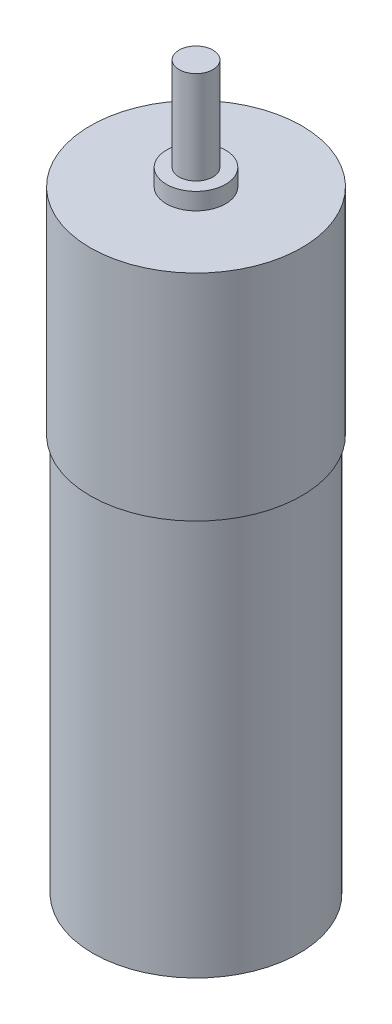
ISO-10303-21;
HEADER;
FILE_DESCRIPTION(('STEP AP214'),'2;1');
FILE_NAME('part.step','',(''),(''),'','','');
FILE_SCHEMA(('AUTOMOTIVE_DESIGN { 1 0 10303 214 1 1 1 1 }'));
ENDSEC;
DATA;
#1=APPLICATION_CONTEXT('core data for automotive mechanical design processes');
#2=APPLICATION_PROTOCOL_DEFINITION('international standard','automotive_design',2000,#1);
#3=PRODUCT_CONTEXT('',#1,'mechanical');
#4=PRODUCT('Part','Part','',(#3));
#5=PRODUCT_RELATED_PRODUCT_CATEGORY('part','',(#4));
#6=PRODUCT_DEFINITION_FORMATION('','',#4);
#7=PRODUCT_DEFINITION_CONTEXT('part definition',#1,'design');
#8=PRODUCT_DEFINITION('design','',#6,#7);
#9=PRODUCT_DEFINITION_SHAPE('','',#8);
#10=(LENGTH_UNIT() NAMED_UNIT(*) SI_UNIT(.MILLI.,.METRE.));
#11=(NAMED_UNIT(*) PLANE_ANGLE_UNIT() SI_UNIT($,.RADIAN.));
#12=(NAMED_UNIT(*) SI_UNIT($,.STERADIAN.) SOLID_ANGLE_UNIT());
#13=UNCERTAINTY_MEASURE_WITH_UNIT(LENGTH_MEASURE(1.E-05),#10,'distance_accuracy_value','');
#14=(GEOMETRIC_REPRESENTATION_CONTEXT(3) GLOBAL_UNCERTAINTY_ASSIGNED_CONTEXT((#13)) GLOBAL_UNIT_ASSIGNED_CONTEXT((#10,
#11,#12)) REPRESENTATION_CONTEXT('',''));
#15=CARTESIAN_POINT('',(0.,0.,0.));
#16=DIRECTION('',(0.,0.,1.));
#17=DIRECTION('',(1.,0.,0.));
#18=AXIS2_PLACEMENT_3D('',#15,#16,#17);
#19=CARTESIAN_POINT('',(0.,47.,0.));
#20=DIRECTION('',(0.,-1.,0.));
#21=DIRECTION('',(0.,0.,-1.));
#22=AXIS2_PLACEMENT_3D('',#19,#20,#21);
#23=CYLINDRICAL_SURFACE('',#22,12.2);
#24=CARTESIAN_POINT('',(0.,47.,0.));
#25=DIRECTION('',(0.,1.,0.));
#26=DIRECTION('',(0.,0.,1.));
#27=AXIS2_PLACEMENT_3D('',#24,#25,#26);
#28=CIRCLE('',#27,12.2);
#29=CARTESIAN_POINT('',(0.,47.,12.2));
#30=VERTEX_POINT('',#29);
#31=EDGE_CURVE('E43',#30,#30,#28,.T.);
#32=ORIENTED_EDGE('',*,*,#31,.F.);
#33=EDGE_LOOP('',(#32));
#34=FACE_BOUND('',#33,.T.);
#35=CARTESIAN_POINT('',(0.,0.,0.));
#36=DIRECTION('',(0.,1.,0.));
#37=DIRECTION('',(0.,0.,1.));
#38=AXIS2_PLACEMENT_3D('',#35,#36,#37);
#39=CIRCLE('',#38,12.2);
#40=CARTESIAN_POINT('',(0.,0.,12.2));
#41=VERTEX_POINT('',#40);
#42=EDGE_CURVE('E34',#41,#41,#39,.T.);
#43=ORIENTED_EDGE('',*,*,#42,.T.);
#44=EDGE_LOOP('',(#43));
#45=FACE_BOUND('',#44,.T.);
#46=ADVANCED_FACE('F31',(#34,#45),#23,.T.);
#47=CARTESIAN_POINT('',(0.,0.,0.));
#48=DIRECTION('',(0.,1.,0.));
#49=DIRECTION('',(0.,0.,1.));
#50=AXIS2_PLACEMENT_3D('',#47,#48,#49);
#51=PLANE('',#50);
#52=ORIENTED_EDGE('',*,*,#42,.F.);
#53=EDGE_LOOP('',(#52));
#54=FACE_BOUND('',#53,.T.);
#55=ADVANCED_FACE('F63',(#54),#51,.F.);
#56=CARTESIAN_POINT('',(0.,72.4,0.));
#57=DIRECTION('',(0.,-1.,0.));
#58=DIRECTION('',(0.,0.,-1.));
#59=AXIS2_PLACEMENT_3D('',#56,#57,#58);
#60=CYLINDRICAL_SURFACE('',#59,12.5);
#61=CARTESIAN_POINT('',(0.,72.4,0.));
#62=DIRECTION('',(0.,1.,0.));
#63=DIRECTION('',(0.,0.,1.));
#64=AXIS2_PLACEMENT_3D('',#61,#62,#63);
#65=CIRCLE('',#64,12.5);
#66=CARTESIAN_POINT('',(0.,72.4,12.5));
#67=VERTEX_POINT('',#66);
#68=EDGE_CURVE('E52',#67,#67,#65,.T.);
#69=ORIENTED_EDGE('',*,*,#68,.F.);
#70=EDGE_LOOP('',(#69));
#71=FACE_BOUND('',#70,.T.);
#72=CARTESIAN_POINT('',(0.,47.,0.));
#73=DIRECTION('',(0.,1.,0.));
#74=DIRECTION('',(0.,0.,1.));
#75=AXIS2_PLACEMENT_3D('',#72,#73,#74);
#76=CIRCLE('',#75,12.5);
#77=CARTESIAN_POINT('',(0.,47.,12.5));
#78=VERTEX_POINT('',#77);
#79=EDGE_CURVE('E50',#78,#78,#76,.T.);
#80=ORIENTED_EDGE('',*,*,#79,.T.);
#81=EDGE_LOOP('',(#80));
#82=FACE_BOUND('',#81,.T.);
#83=ADVANCED_FACE('F65',(#71,#82),#60,.T.);
#84=CARTESIAN_POINT('',(0.,72.4,0.));
#85=DIRECTION('',(0.,1.,0.));
#86=DIRECTION('',(0.,0.,1.));
#87=AXIS2_PLACEMENT_3D('',#84,#85,#86);
#88=PLANE('',#87);
#89=CARTESIAN_POINT('',(0.,72.4,0.));
#90=DIRECTION('',(0.,1.,0.));
#91=DIRECTION('',(0.,0.,1.));
#92=AXIS2_PLACEMENT_3D('',#89,#90,#91);
#93=CIRCLE('',#92,3.5);
#94=CARTESIAN_POINT('',(0.,72.4,3.5));
#95=VERTEX_POINT('',#94);
#96=EDGE_CURVE('E38',#95,#95,#93,.T.);
#97=ORIENTED_EDGE('',*,*,#96,.F.);
#98=EDGE_LOOP('',(#97));
#99=FACE_BOUND('',#98,.T.);
#100=ORIENTED_EDGE('',*,*,#68,.T.);
#101=EDGE_LOOP('',(#100));
#102=FACE_BOUND('',#101,.T.);
#103=ADVANCED_FACE('F70',(#99,#102),#88,.T.);
#104=CARTESIAN_POINT('',(0.,47.,0.));
#105=DIRECTION('',(0.,1.,0.));
#106=DIRECTION('',(0.,0.,1.));
#107=AXIS2_PLACEMENT_3D('',#104,#105,#106);
#108=PLANE('',#107);
#109=ORIENTED_EDGE('',*,*,#31,.T.);
#110=EDGE_LOOP('',(#109));
#111=FACE_BOUND('',#110,.T.);
#112=ORIENTED_EDGE('',*,*,#79,.F.);
#113=EDGE_LOOP('',(#112));
#114=FACE_BOUND('',#113,.T.);
#115=ADVANCED_FACE('F75',(#111,#114),#108,.F.);
#116=CARTESIAN_POINT('',(0.,74.4,0.));
#117=DIRECTION('',(0.,-1.,0.));
#118=DIRECTION('',(0.,0.,-1.));
#119=AXIS2_PLACEMENT_3D('',#116,#117,#118);
#120=CYLINDRICAL_SURFACE('',#119,3.5);
#121=CARTESIAN_POINT('',(0.,74.4,0.));
#122=DIRECTION('',(0.,1.,0.));
#123=DIRECTION('',(0.,0.,1.));
#124=AXIS2_PLACEMENT_3D('',#121,#122,#123);
#125=CIRCLE('',#124,3.5);
#126=CARTESIAN_POINT('',(0.,74.4,3.5));
#127=VERTEX_POINT('',#126);
#128=EDGE_CURVE('E48',#127,#127,#125,.T.);
#129=ORIENTED_EDGE('',*,*,#128,.F.);
#130=EDGE_LOOP('',(#129));
#131=FACE_BOUND('',#130,.T.);
#132=ORIENTED_EDGE('',*,*,#96,.T.);
#133=EDGE_LOOP('',(#132));
#134=FACE_BOUND('',#133,.T.);
#135=ADVANCED_FACE('F78',(#131,#134),#120,.T.);
#136=CARTESIAN_POINT('',(0.,74.4,0.));
#137=DIRECTION('',(0.,1.,0.));
#138=DIRECTION('',(0.,0.,1.));
#139=AXIS2_PLACEMENT_3D('',#136,#137,#138);
#140=PLANE('',#139);
#141=CARTESIAN_POINT('',(0.,74.4,0.));
#142=DIRECTION('',(0.,1.,0.));
#143=DIRECTION('',(0.,0.,1.));
#144=AXIS2_PLACEMENT_3D('',#141,#142,#143);
#145=CIRCLE('',#144,2.);
#146=CARTESIAN_POINT('',(0.,74.4,2.));
#147=VERTEX_POINT('',#146);
#148=EDGE_CURVE('E10',#147,#147,#145,.T.);
#149=ORIENTED_EDGE('',*,*,#148,.F.);
#150=EDGE_LOOP('',(#149));
#151=FACE_BOUND('',#150,.T.);
#152=ORIENTED_EDGE('',*,*,#128,.T.);
#153=EDGE_LOOP('',(#152));
#154=FACE_BOUND('',#153,.T.);
#155=ADVANCED_FACE('F84',(#151,#154),#140,.T.);
#156=CARTESIAN_POINT('',(0.,85.4,0.));
#157=DIRECTION('',(0.,-1.,0.));
#158=DIRECTION('',(0.,0.,-1.));
#159=AXIS2_PLACEMENT_3D('',#156,#157,#158);
#160=CYLINDRICAL_SURFACE('',#159,2.);
#161=CARTESIAN_POINT('',(0.,85.4,0.));
#162=DIRECTION('',(0.,1.,0.));
#163=DIRECTION('',(0.,0.,1.));
#164=AXIS2_PLACEMENT_3D('',#161,#162,#163);
#165=CIRCLE('',#164,2.);
#166=CARTESIAN_POINT('',(0.,85.4,2.));
#167=VERTEX_POINT('',#166);
#168=EDGE_CURVE('E47',#167,#167,#165,.T.);
#169=ORIENTED_EDGE('',*,*,#168,.F.);
#170=EDGE_LOOP('',(#169));
#171=FACE_BOUND('',#170,.T.);
#172=ORIENTED_EDGE('',*,*,#148,.T.);
#173=EDGE_LOOP('',(#172));
#174=FACE_BOUND('',#173,.T.);
#175=ADVANCED_FACE('F88',(#171,#174),#160,.T.);
#176=CARTESIAN_POINT('',(0.,85.4,0.));
#177=DIRECTION('',(0.,1.,0.));
#178=DIRECTION('',(0.,0.,1.));
#179=AXIS2_PLACEMENT_3D('',#176,#177,#178);
#180=PLANE('',#179);
#181=ORIENTED_EDGE('',*,*,#168,.T.);
#182=EDGE_LOOP('',(#181));
#183=FACE_BOUND('',#182,.T.);
#184=ADVANCED_FACE('F92',(#183),#180,.T.);
#185=CLOSED_SHELL('',(#46,#55,#83,#103,#115,#135,#155,#175,#184));
#186=MANIFOLD_SOLID_BREP('B2',#185);
#187=ADVANCED_BREP_SHAPE_REPRESENTATION('',(#18,#186),#14);
#188=SHAPE_DEFINITION_REPRESENTATION(#9,#187);
ENDSEC;
END-ISO-10303-21;
